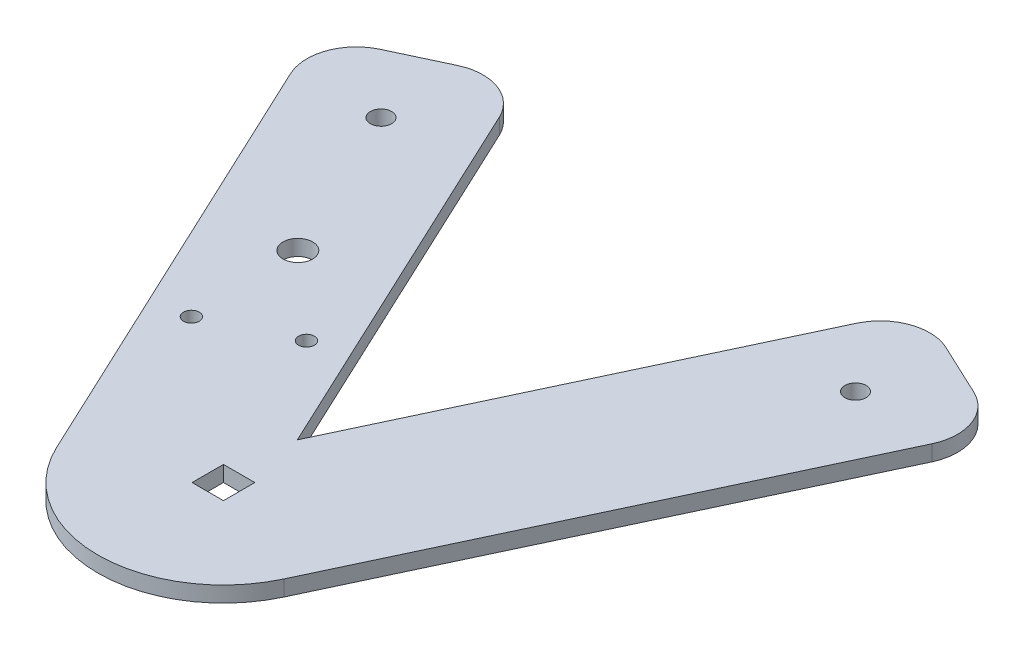
ISO-10303-21;
HEADER;
FILE_DESCRIPTION(('STEP AP214'),'2;1');
FILE_NAME('part.step','',(''),(''),'','','');
FILE_SCHEMA(('AUTOMOTIVE_DESIGN { 1 0 10303 214 1 1 1 1 }'));
ENDSEC;
DATA;
#1=APPLICATION_CONTEXT('core data for automotive mechanical design processes');
#2=APPLICATION_PROTOCOL_DEFINITION('international standard','automotive_design',2000,#1);
#3=PRODUCT_CONTEXT('',#1,'mechanical');
#4=PRODUCT('Part','Part','',(#3));
#5=PRODUCT_RELATED_PRODUCT_CATEGORY('part','',(#4));
#6=PRODUCT_DEFINITION_FORMATION('','',#4);
#7=PRODUCT_DEFINITION_CONTEXT('part definition',#1,'design');
#8=PRODUCT_DEFINITION('design','',#6,#7);
#9=PRODUCT_DEFINITION_SHAPE('','',#8);
#10=(LENGTH_UNIT() NAMED_UNIT(*) SI_UNIT(.MILLI.,.METRE.));
#11=(NAMED_UNIT(*) PLANE_ANGLE_UNIT() SI_UNIT($,.RADIAN.));
#12=(NAMED_UNIT(*) SI_UNIT($,.STERADIAN.) SOLID_ANGLE_UNIT());
#13=UNCERTAINTY_MEASURE_WITH_UNIT(LENGTH_MEASURE(1.E-05),#10,'distance_accuracy_value','');
#14=(GEOMETRIC_REPRESENTATION_CONTEXT(3) GLOBAL_UNCERTAINTY_ASSIGNED_CONTEXT((#13)) GLOBAL_UNIT_ASSIGNED_CONTEXT((#10,
#11,#12)) REPRESENTATION_CONTEXT('',''));
#15=CARTESIAN_POINT('',(0.,0.,0.));
#16=DIRECTION('',(0.,0.,1.));
#17=DIRECTION('',(1.,0.,0.));
#18=AXIS2_PLACEMENT_3D('',#15,#16,#17);
#19=CARTESIAN_POINT('',(0.,3.175,0.));
#20=DIRECTION('',(0.,-1.,0.));
#21=DIRECTION('',(0.,0.,-1.));
#22=AXIS2_PLACEMENT_3D('',#19,#20,#21);
#23=PLANE('',#22);
#24=CARTESIAN_POINT('',(-47.994,3.175,-79.8633619940959));
#25=DIRECTION('',(0.,1.,0.));
#26=DIRECTION('',(0.,0.,1.));
#27=AXIS2_PLACEMENT_3D('',#24,#25,#26);
#28=CIRCLE('',#27,2.15);
#29=CARTESIAN_POINT('',(-47.994,3.175,-77.7133619940959));
#30=VERTEX_POINT('',#29);
#31=EDGE_CURVE('E193',#30,#30,#28,.T.);
#32=ORIENTED_EDGE('',*,*,#31,.F.);
#33=EDGE_LOOP('',(#32));
#34=FACE_BOUND('',#33,.T.);
#35=CARTESIAN_POINT('',(47.994,3.175,-79.8633619940959));
#36=DIRECTION('',(0.,1.,0.));
#37=DIRECTION('',(0.,0.,1.));
#38=AXIS2_PLACEMENT_3D('',#35,#36,#37);
#39=CIRCLE('',#38,2.15);
#40=CARTESIAN_POINT('',(47.994,3.175,-77.7133619940959));
#41=VERTEX_POINT('',#40);
#42=EDGE_CURVE('E199',#41,#41,#39,.T.);
#43=ORIENTED_EDGE('',*,*,#42,.F.);
#44=EDGE_LOOP('',(#43));
#45=FACE_BOUND('',#44,.T.);
#46=DIRECTION('',(0.424774594596016,0.,-0.90529914602069));
#47=VECTOR('',#46,1.);
#48=CARTESIAN_POINT('',(22.9945983089255,3.175,10.7892747027388));
#49=LINE('',#48,#47);
#50=CARTESIAN_POINT('',(22.9945983089255,3.175,10.7892747027388));
#51=VERTEX_POINT('',#50);
#52=CARTESIAN_POINT('',(64.8611746863301,3.175,-78.4386977877557));
#53=VERTEX_POINT('',#52);
#54=EDGE_CURVE('E213',#51,#53,#49,.T.);
#55=ORIENTED_EDGE('',*,*,#54,.T.);
#56=CARTESIAN_POINT('',(55.8081832261232,3.175,-82.6864437337158));
#57=DIRECTION('',(0.,-1.,0.));
#58=DIRECTION('',(0.,0.,-1.));
#59=AXIS2_PLACEMENT_3D('',#56,#57,#58);
#60=CIRCLE('',#59,10.);
#61=CARTESIAN_POINT('',(60.0559291720833,3.175,-91.7394351939227));
#62=VERTEX_POINT('',#61);
#63=EDGE_CURVE('E266',#53,#62,#60,.F.);
#64=ORIENTED_EDGE('',*,*,#63,.T.);
#65=DIRECTION('',(-0.90529914602069,0.,-0.424774594596016));
#66=VECTOR('',#65,1.);
#67=CARTESIAN_POINT('',(40.3656727461333,3.175,-100.978282626386));
#68=LINE('',#67,#66);
#69=CARTESIAN_POINT('',(49.4186642063402,3.175,-96.7305366804259));
#70=VERTEX_POINT('',#69);
#71=EDGE_CURVE('E216',#62,#70,#68,.T.);
#72=ORIENTED_EDGE('',*,*,#71,.T.);
#73=CARTESIAN_POINT('',(45.1709182603801,3.175,-87.677545220219));
#74=DIRECTION('',(0.,-1.,0.));
#75=DIRECTION('',(0.,0.,-1.));
#76=AXIS2_PLACEMENT_3D('',#73,#74,#75);
#77=CIRCLE('',#76,10.);
#78=CARTESIAN_POINT('',(36.1179268001732,3.175,-91.9252911661792));
#79=VERTEX_POINT('',#78);
#80=EDGE_CURVE('E61',#70,#79,#77,.F.);
#81=ORIENTED_EDGE('',*,*,#80,.T.);
#82=DIRECTION('',(-0.424774594596016,0.,0.90529914602069));
#83=VECTOR('',#82,1.);
#84=CARTESIAN_POINT('',(0.,3.175,-14.9491049624547));
#85=LINE('',#84,#83);
#86=CARTESIAN_POINT('',(0.,3.175,-14.9491049624547));
#87=VERTEX_POINT('',#86);
#88=EDGE_CURVE('E218',#79,#87,#85,.T.);
#89=ORIENTED_EDGE('',*,*,#88,.T.);
#90=DIRECTION('',(-0.424774594596016,0.,-0.90529914602069));
#91=VECTOR('',#90,1.);
#92=CARTESIAN_POINT('',(-40.3656727461333,3.175,-100.978282626386));
#93=LINE('',#92,#91);
#94=CARTESIAN_POINT('',(-36.1179268001732,3.175,-91.9252911661792));
#95=VERTEX_POINT('',#94);
#96=EDGE_CURVE('E220',#87,#95,#93,.T.);
#97=ORIENTED_EDGE('',*,*,#96,.T.);
#98=CARTESIAN_POINT('',(-45.1709182603801,3.175,-87.677545220219));
#99=DIRECTION('',(0.,-1.,0.));
#100=DIRECTION('',(0.,0.,-1.));
#101=AXIS2_PLACEMENT_3D('',#98,#99,#100);
#102=CIRCLE('',#101,10.);
#103=CARTESIAN_POINT('',(-49.4186642063402,3.175,-96.7305366804259));
#104=VERTEX_POINT('',#103);
#105=EDGE_CURVE('E263',#95,#104,#102,.F.);
#106=ORIENTED_EDGE('',*,*,#105,.T.);
#107=DIRECTION('',(-0.905299146020689,0.,0.424774594596017));
#108=VECTOR('',#107,1.);
#109=CARTESIAN_POINT('',(-69.1089206322902,3.175,-87.4916892479626));
#110=LINE('',#109,#108);
#111=CARTESIAN_POINT('',(-60.0559291720833,3.175,-91.7394351939227));
#112=VERTEX_POINT('',#111);
#113=EDGE_CURVE('E205',#104,#112,#110,.T.);
#114=ORIENTED_EDGE('',*,*,#113,.T.);
#115=CARTESIAN_POINT('',(-55.8081832261231,3.175,-82.6864437337158));
#116=DIRECTION('',(0.,-1.,0.));
#117=DIRECTION('',(0.,0.,-1.));
#118=AXIS2_PLACEMENT_3D('',#115,#116,#117);
#119=CIRCLE('',#118,10.);
#120=CARTESIAN_POINT('',(-64.86117468633,3.175,-78.4386977877557));
#121=VERTEX_POINT('',#120);
#122=EDGE_CURVE('E261',#112,#121,#119,.F.);
#123=ORIENTED_EDGE('',*,*,#122,.T.);
#124=DIRECTION('',(0.424774594596016,0.,0.90529914602069));
#125=VECTOR('',#124,1.);
#126=CARTESIAN_POINT('',(-69.1089206322902,3.175,-87.4916892479626));
#127=LINE('',#126,#125);
#128=CARTESIAN_POINT('',(-22.9945983089255,3.175,10.7892747027388));
#129=VERTEX_POINT('',#128);
#130=EDGE_CURVE('E208',#121,#129,#127,.T.);
#131=ORIENTED_EDGE('',*,*,#130,.T.);
#132=CARTESIAN_POINT('',(0.,3.175,0.));
#133=DIRECTION('',(0.,1.,0.));
#134=DIRECTION('',(0.,0.,-1.));
#135=AXIS2_PLACEMENT_3D('',#132,#133,#134);
#136=CIRCLE('',#135,25.4);
#137=EDGE_CURVE('E211',#129,#51,#136,.T.);
#138=ORIENTED_EDGE('',*,*,#137,.T.);
#139=EDGE_LOOP('',(#55,#64,#72,#81,#89,#97,#106,#114,#123,#131,#138));
#140=FACE_BOUND('',#139,.T.);
#141=DIRECTION('',(0.,0.,-1.));
#142=VECTOR('',#141,1.);
#143=CARTESIAN_POINT('',(3.175,3.175,3.175));
#144=LINE('',#143,#142);
#145=CARTESIAN_POINT('',(3.175,3.175,3.175));
#146=VERTEX_POINT('',#145);
#147=CARTESIAN_POINT('',(3.175,3.175,-3.175));
#148=VERTEX_POINT('',#147);
#149=EDGE_CURVE('E149',#146,#148,#144,.T.);
#150=ORIENTED_EDGE('',*,*,#149,.F.);
#151=DIRECTION('',(1.,0.,0.));
#152=VECTOR('',#151,1.);
#153=CARTESIAN_POINT('',(-3.175,3.175,3.175));
#154=LINE('',#153,#152);
#155=CARTESIAN_POINT('',(-3.175,3.175,3.175));
#156=VERTEX_POINT('',#155);
#157=EDGE_CURVE('E175',#156,#146,#154,.T.);
#158=ORIENTED_EDGE('',*,*,#157,.F.);
#159=DIRECTION('',(0.,0.,1.));
#160=VECTOR('',#159,1.);
#161=CARTESIAN_POINT('',(-3.175,3.175,3.175));
#162=LINE('',#161,#160);
#163=CARTESIAN_POINT('',(-3.175,3.175,-3.175));
#164=VERTEX_POINT('',#163);
#165=EDGE_CURVE('E173',#164,#156,#162,.T.);
#166=ORIENTED_EDGE('',*,*,#165,.F.);
#167=DIRECTION('',(-1.,0.,0.));
#168=VECTOR('',#167,1.);
#169=CARTESIAN_POINT('',(-3.175,3.175,-3.175));
#170=LINE('',#169,#168);
#171=EDGE_CURVE('E159',#148,#164,#170,.T.);
#172=ORIENTED_EDGE('',*,*,#171,.F.);
#173=EDGE_LOOP('',(#150,#158,#166,#172));
#174=FACE_BOUND('',#173,.T.);
#175=CARTESIAN_POINT('',(-33.1268891891394,3.175,-48.1778918833717));
#176=DIRECTION('',(0.,1.,0.));
#177=DIRECTION('',(0.,0.,1.));
#178=AXIS2_PLACEMENT_3D('',#175,#176,#177);
#179=CIRCLE('',#178,3.);
#180=CARTESIAN_POINT('',(-33.1268891891394,3.175,-45.1778918833717));
#181=VERTEX_POINT('',#180);
#182=EDGE_CURVE('E182',#181,#181,#179,.T.);
#183=ORIENTED_EDGE('',*,*,#182,.F.);
#184=EDGE_LOOP('',(#183));
#185=FACE_BOUND('',#184,.T.);
#186=CARTESIAN_POINT('',(-16.4551650127805,3.175,-33.2455071780607));
#187=DIRECTION('',(0.,1.,0.));
#188=DIRECTION('',(0.,0.,1.));
#189=AXIS2_PLACEMENT_3D('',#186,#187,#188);
#190=CIRCLE('',#189,1.6);
#191=CARTESIAN_POINT('',(-16.4551650127805,3.175,-31.6455071780607));
#192=VERTEX_POINT('',#191);
#193=EDGE_CURVE('E416',#192,#192,#190,.T.);
#194=ORIENTED_EDGE('',*,*,#193,.F.);
#195=EDGE_LOOP('',(#194));
#196=FACE_BOUND('',#195,.T.);
#197=CARTESIAN_POINT('',(-32.2979000681425,3.175,-25.8119517726304));
#198=DIRECTION('',(0.,1.,0.));
#199=DIRECTION('',(0.,0.,1.));
#200=AXIS2_PLACEMENT_3D('',#197,#198,#199);
#201=CIRCLE('',#200,1.60000000000001);
#202=CARTESIAN_POINT('',(-32.2979000681425,3.175,-24.2119517726304));
#203=VERTEX_POINT('',#202);
#204=EDGE_CURVE('E411',#203,#203,#201,.T.);
#205=ORIENTED_EDGE('',*,*,#204,.F.);
#206=EDGE_LOOP('',(#205));
#207=FACE_BOUND('',#206,.T.);
#208=ADVANCED_FACE('F39',(#34,#45,#140,#174,#185,#196,#207),#23,.F.);
#209=CARTESIAN_POINT('',(0.,0.,0.));
#210=DIRECTION('',(0.,-1.,0.));
#211=DIRECTION('',(0.,0.,-1.));
#212=AXIS2_PLACEMENT_3D('',#209,#210,#211);
#213=PLANE('',#212);
#214=CARTESIAN_POINT('',(-16.4551650127805,0.,-33.2455071780607));
#215=DIRECTION('',(0.,1.,0.));
#216=DIRECTION('',(0.,0.,1.));
#217=AXIS2_PLACEMENT_3D('',#214,#215,#216);
#218=CIRCLE('',#217,1.6);
#219=CARTESIAN_POINT('',(-16.4551650127805,0.,-31.6455071780607));
#220=VERTEX_POINT('',#219);
#221=EDGE_CURVE('E413',#220,#220,#218,.T.);
#222=ORIENTED_EDGE('',*,*,#221,.T.);
#223=EDGE_LOOP('',(#222));
#224=FACE_BOUND('',#223,.T.);
#225=DIRECTION('',(1.,0.,0.));
#226=VECTOR('',#225,1.);
#227=CARTESIAN_POINT('',(-3.175,0.,3.175));
#228=LINE('',#227,#226);
#229=CARTESIAN_POINT('',(-3.175,0.,3.175));
#230=VERTEX_POINT('',#229);
#231=CARTESIAN_POINT('',(3.175,0.,3.175));
#232=VERTEX_POINT('',#231);
#233=EDGE_CURVE('E160',#230,#232,#228,.T.);
#234=ORIENTED_EDGE('',*,*,#233,.T.);
#235=DIRECTION('',(0.,0.,-1.));
#236=VECTOR('',#235,1.);
#237=CARTESIAN_POINT('',(3.175,0.,3.175));
#238=LINE('',#237,#236);
#239=CARTESIAN_POINT('',(3.175,0.,-3.175));
#240=VERTEX_POINT('',#239);
#241=EDGE_CURVE('E180',#232,#240,#238,.T.);
#242=ORIENTED_EDGE('',*,*,#241,.T.);
#243=DIRECTION('',(-1.,0.,0.));
#244=VECTOR('',#243,1.);
#245=CARTESIAN_POINT('',(-3.175,0.,-3.175));
#246=LINE('',#245,#244);
#247=CARTESIAN_POINT('',(-3.175,0.,-3.175));
#248=VERTEX_POINT('',#247);
#249=EDGE_CURVE('E166',#240,#248,#246,.T.);
#250=ORIENTED_EDGE('',*,*,#249,.T.);
#251=DIRECTION('',(0.,0.,1.));
#252=VECTOR('',#251,1.);
#253=CARTESIAN_POINT('',(-3.175,0.,3.175));
#254=LINE('',#253,#252);
#255=EDGE_CURVE('E184',#248,#230,#254,.T.);
#256=ORIENTED_EDGE('',*,*,#255,.T.);
#257=EDGE_LOOP('',(#234,#242,#250,#256));
#258=FACE_BOUND('',#257,.T.);
#259=CARTESIAN_POINT('',(-47.994,0.,-79.8633619940959));
#260=DIRECTION('',(0.,1.,0.));
#261=DIRECTION('',(0.,0.,1.));
#262=AXIS2_PLACEMENT_3D('',#259,#260,#261);
#263=CIRCLE('',#262,2.15);
#264=CARTESIAN_POINT('',(-47.994,0.,-77.7133619940959));
#265=VERTEX_POINT('',#264);
#266=EDGE_CURVE('E167',#265,#265,#263,.T.);
#267=ORIENTED_EDGE('',*,*,#266,.T.);
#268=EDGE_LOOP('',(#267));
#269=FACE_BOUND('',#268,.T.);
#270=DIRECTION('',(-0.90529914602069,0.,-0.424774594596016));
#271=VECTOR('',#270,1.);
#272=CARTESIAN_POINT('',(40.3656727461333,0.,-100.978282626386));
#273=LINE('',#272,#271);
#274=CARTESIAN_POINT('',(60.0559291720833,0.,-91.7394351939227));
#275=VERTEX_POINT('',#274);
#276=CARTESIAN_POINT('',(49.4186642063402,0.,-96.7305366804259));
#277=VERTEX_POINT('',#276);
#278=EDGE_CURVE('E232',#275,#277,#273,.T.);
#279=ORIENTED_EDGE('',*,*,#278,.F.);
#280=CARTESIAN_POINT('',(55.8081832261232,0.,-82.6864437337158));
#281=DIRECTION('',(0.,-1.,0.));
#282=DIRECTION('',(0.,0.,-1.));
#283=AXIS2_PLACEMENT_3D('',#280,#281,#282);
#284=CIRCLE('',#283,10.);
#285=CARTESIAN_POINT('',(64.8611746863301,0.,-78.4386977877557));
#286=VERTEX_POINT('',#285);
#287=EDGE_CURVE('E257',#275,#286,#284,.T.);
#288=ORIENTED_EDGE('',*,*,#287,.T.);
#289=DIRECTION('',(0.424774594596016,0.,-0.90529914602069));
#290=VECTOR('',#289,1.);
#291=CARTESIAN_POINT('',(22.9945983089255,0.,10.7892747027388));
#292=LINE('',#291,#290);
#293=CARTESIAN_POINT('',(22.9945983089255,0.,10.7892747027388));
#294=VERTEX_POINT('',#293);
#295=EDGE_CURVE('E229',#294,#286,#292,.T.);
#296=ORIENTED_EDGE('',*,*,#295,.F.);
#297=CARTESIAN_POINT('',(0.,0.,0.));
#298=DIRECTION('',(0.,1.,0.));
#299=DIRECTION('',(0.,0.,-1.));
#300=AXIS2_PLACEMENT_3D('',#297,#298,#299);
#301=CIRCLE('',#300,25.4);
#302=CARTESIAN_POINT('',(-22.9945983089255,0.,10.7892747027388));
#303=VERTEX_POINT('',#302);
#304=EDGE_CURVE('E227',#303,#294,#301,.T.);
#305=ORIENTED_EDGE('',*,*,#304,.F.);
#306=DIRECTION('',(0.424774594596016,0.,0.90529914602069));
#307=VECTOR('',#306,1.);
#308=CARTESIAN_POINT('',(-69.1089206322902,0.,-87.4916892479626));
#309=LINE('',#308,#307);
#310=CARTESIAN_POINT('',(-64.86117468633,0.,-78.4386977877557));
#311=VERTEX_POINT('',#310);
#312=EDGE_CURVE('E225',#311,#303,#309,.T.);
#313=ORIENTED_EDGE('',*,*,#312,.F.);
#314=CARTESIAN_POINT('',(-55.8081832261231,0.,-82.6864437337158));
#315=DIRECTION('',(0.,-1.,0.));
#316=DIRECTION('',(0.,0.,-1.));
#317=AXIS2_PLACEMENT_3D('',#314,#315,#316);
#318=CIRCLE('',#317,10.);
#319=CARTESIAN_POINT('',(-60.0559291720833,0.,-91.7394351939227));
#320=VERTEX_POINT('',#319);
#321=EDGE_CURVE('E251',#311,#320,#318,.T.);
#322=ORIENTED_EDGE('',*,*,#321,.T.);
#323=DIRECTION('',(-0.905299146020689,0.,0.424774594596017));
#324=VECTOR('',#323,1.);
#325=CARTESIAN_POINT('',(-69.1089206322902,0.,-87.4916892479626));
#326=LINE('',#325,#324);
#327=CARTESIAN_POINT('',(-49.4186642063402,0.,-96.7305366804259));
#328=VERTEX_POINT('',#327);
#329=EDGE_CURVE('E202',#328,#320,#326,.T.);
#330=ORIENTED_EDGE('',*,*,#329,.F.);
#331=CARTESIAN_POINT('',(-45.1709182603801,0.,-87.677545220219));
#332=DIRECTION('',(0.,-1.,0.));
#333=DIRECTION('',(0.,0.,-1.));
#334=AXIS2_PLACEMENT_3D('',#331,#332,#333);
#335=CIRCLE('',#334,10.);
#336=CARTESIAN_POINT('',(-36.1179268001732,0.,-91.9252911661792));
#337=VERTEX_POINT('',#336);
#338=EDGE_CURVE('E253',#328,#337,#335,.T.);
#339=ORIENTED_EDGE('',*,*,#338,.T.);
#340=DIRECTION('',(-0.424774594596016,0.,-0.90529914602069));
#341=VECTOR('',#340,1.);
#342=CARTESIAN_POINT('',(-40.3656727461333,0.,-100.978282626386));
#343=LINE('',#342,#341);
#344=CARTESIAN_POINT('',(0.,0.,-14.9491049624547));
#345=VERTEX_POINT('',#344);
#346=EDGE_CURVE('E209',#345,#337,#343,.T.);
#347=ORIENTED_EDGE('',*,*,#346,.F.);
#348=DIRECTION('',(-0.424774594596016,0.,0.90529914602069));
#349=VECTOR('',#348,1.);
#350=CARTESIAN_POINT('',(0.,0.,-14.9491049624547));
#351=LINE('',#350,#349);
#352=CARTESIAN_POINT('',(36.1179268001732,0.,-91.9252911661792));
#353=VERTEX_POINT('',#352);
#354=EDGE_CURVE('E235',#353,#345,#351,.T.);
#355=ORIENTED_EDGE('',*,*,#354,.F.);
#356=CARTESIAN_POINT('',(45.1709182603801,0.,-87.677545220219));
#357=DIRECTION('',(0.,-1.,0.));
#358=DIRECTION('',(0.,0.,-1.));
#359=AXIS2_PLACEMENT_3D('',#356,#357,#358);
#360=CIRCLE('',#359,10.);
#361=EDGE_CURVE('E255',#353,#277,#360,.T.);
#362=ORIENTED_EDGE('',*,*,#361,.T.);
#363=EDGE_LOOP('',(#279,#288,#296,#305,#313,#322,#330,#339,#347,#355,#362));
#364=FACE_BOUND('',#363,.T.);
#365=CARTESIAN_POINT('',(47.994,0.,-79.8633619940959));
#366=DIRECTION('',(0.,1.,0.));
#367=DIRECTION('',(0.,0.,1.));
#368=AXIS2_PLACEMENT_3D('',#365,#366,#367);
#369=CIRCLE('',#368,2.15);
#370=CARTESIAN_POINT('',(47.994,0.,-77.7133619940959));
#371=VERTEX_POINT('',#370);
#372=EDGE_CURVE('E196',#371,#371,#369,.T.);
#373=ORIENTED_EDGE('',*,*,#372,.T.);
#374=EDGE_LOOP('',(#373));
#375=FACE_BOUND('',#374,.T.);
#376=CARTESIAN_POINT('',(-33.1268891891394,0.,-48.1778918833717));
#377=DIRECTION('',(0.,1.,0.));
#378=DIRECTION('',(0.,0.,1.));
#379=AXIS2_PLACEMENT_3D('',#376,#377,#378);
#380=CIRCLE('',#379,3.);
#381=CARTESIAN_POINT('',(-33.1268891891394,0.,-45.1778918833717));
#382=VERTEX_POINT('',#381);
#383=EDGE_CURVE('E407',#382,#382,#380,.T.);
#384=ORIENTED_EDGE('',*,*,#383,.T.);
#385=EDGE_LOOP('',(#384));
#386=FACE_BOUND('',#385,.T.);
#387=CARTESIAN_POINT('',(-32.2979000681425,0.,-25.8119517726304));
#388=DIRECTION('',(0.,1.,0.));
#389=DIRECTION('',(0.,0.,1.));
#390=AXIS2_PLACEMENT_3D('',#387,#388,#389);
#391=CIRCLE('',#390,1.60000000000001);
#392=CARTESIAN_POINT('',(-32.2979000681425,0.,-24.2119517726304));
#393=VERTEX_POINT('',#392);
#394=EDGE_CURVE('E410',#393,#393,#391,.T.);
#395=ORIENTED_EDGE('',*,*,#394,.T.);
#396=EDGE_LOOP('',(#395));
#397=FACE_BOUND('',#396,.T.);
#398=ADVANCED_FACE('F285',(#224,#258,#269,#364,#375,#386,#397),#213,.T.);
#399=CARTESIAN_POINT('',(-69.1089206322902,3.175,-87.4916892479626));
#400=DIRECTION('',(0.424774594596017,0.,0.905299146020689));
#401=DIRECTION('',(0.90529914602069,0.,-0.424774594596017));
#402=AXIS2_PLACEMENT_3D('',#399,#400,#401);
#403=PLANE('',#402);
#404=ORIENTED_EDGE('',*,*,#113,.F.);
#405=DIRECTION('',(0.,-1.,0.));
#406=VECTOR('',#405,1.);
#407=CARTESIAN_POINT('',(-49.4186642063402,3.175,-96.7305366804259));
#408=LINE('',#407,#406);
#409=EDGE_CURVE('E273',#104,#328,#408,.T.);
#410=ORIENTED_EDGE('',*,*,#409,.T.);
#411=ORIENTED_EDGE('',*,*,#329,.T.);
#412=DIRECTION('',(0.,-1.,0.));
#413=VECTOR('',#412,1.);
#414=CARTESIAN_POINT('',(-60.0559291720833,3.175,-91.7394351939227));
#415=LINE('',#414,#413);
#416=EDGE_CURVE('E271',#320,#112,#415,.F.);
#417=ORIENTED_EDGE('',*,*,#416,.T.);
#418=EDGE_LOOP('',(#404,#410,#411,#417));
#419=FACE_BOUND('',#418,.T.);
#420=ADVANCED_FACE('F279',(#419),#403,.F.);
#421=CARTESIAN_POINT('',(-69.1089206322902,3.175,-87.4916892479626));
#422=DIRECTION('',(0.90529914602069,0.,-0.424774594596016));
#423=DIRECTION('',(-0.424774594596016,0.,-0.90529914602069));
#424=AXIS2_PLACEMENT_3D('',#421,#422,#423);
#425=PLANE('',#424);
#426=ORIENTED_EDGE('',*,*,#130,.F.);
#427=DIRECTION('',(0.,-1.,0.));
#428=VECTOR('',#427,1.);
#429=CARTESIAN_POINT('',(-64.86117468633,3.175,-78.4386977877557));
#430=LINE('',#429,#428);
#431=EDGE_CURVE('E11',#121,#311,#430,.T.);
#432=ORIENTED_EDGE('',*,*,#431,.T.);
#433=ORIENTED_EDGE('',*,*,#312,.T.);
#434=DIRECTION('',(0.,-1.,0.));
#435=VECTOR('',#434,1.);
#436=CARTESIAN_POINT('',(-22.9945983089255,3.175,10.7892747027388));
#437=LINE('',#436,#435);
#438=EDGE_CURVE('E243',#129,#303,#437,.T.);
#439=ORIENTED_EDGE('',*,*,#438,.F.);
#440=EDGE_LOOP('',(#426,#432,#433,#439));
#441=FACE_BOUND('',#440,.T.);
#442=ADVANCED_FACE('F295',(#441),#425,.F.);
#443=CARTESIAN_POINT('',(0.,3.175,0.));
#444=DIRECTION('',(0.,-1.,0.));
#445=DIRECTION('',(0.,0.,-1.));
#446=AXIS2_PLACEMENT_3D('',#443,#444,#445);
#447=CYLINDRICAL_SURFACE('',#446,25.4);
#448=ORIENTED_EDGE('',*,*,#304,.T.);
#449=DIRECTION('',(0.,-1.,0.));
#450=VECTOR('',#449,1.);
#451=CARTESIAN_POINT('',(22.9945983089255,3.175,10.7892747027388));
#452=LINE('',#451,#450);
#453=EDGE_CURVE('E240',#51,#294,#452,.T.);
#454=ORIENTED_EDGE('',*,*,#453,.F.);
#455=ORIENTED_EDGE('',*,*,#137,.F.);
#456=ORIENTED_EDGE('',*,*,#438,.T.);
#457=EDGE_LOOP('',(#448,#454,#455,#456));
#458=FACE_BOUND('',#457,.T.);
#459=ADVANCED_FACE('F338',(#458),#447,.T.);
#460=CARTESIAN_POINT('',(22.9945983089255,3.175,10.7892747027388));
#461=DIRECTION('',(-0.90529914602069,0.,-0.424774594596016));
#462=DIRECTION('',(-0.424774594596016,0.,0.90529914602069));
#463=AXIS2_PLACEMENT_3D('',#460,#461,#462);
#464=PLANE('',#463);
#465=ORIENTED_EDGE('',*,*,#295,.T.);
#466=DIRECTION('',(0.,-1.,0.));
#467=VECTOR('',#466,1.);
#468=CARTESIAN_POINT('',(64.86117468633,3.175,-78.4386977877557));
#469=LINE('',#468,#467);
#470=EDGE_CURVE('E259',#286,#53,#469,.F.);
#471=ORIENTED_EDGE('',*,*,#470,.T.);
#472=ORIENTED_EDGE('',*,*,#54,.F.);
#473=ORIENTED_EDGE('',*,*,#453,.T.);
#474=EDGE_LOOP('',(#465,#471,#472,#473));
#475=FACE_BOUND('',#474,.T.);
#476=ADVANCED_FACE('F334',(#475),#464,.F.);
#477=CARTESIAN_POINT('',(40.3656727461333,3.175,-100.978282626386));
#478=DIRECTION('',(-0.424774594596016,0.,0.90529914602069));
#479=DIRECTION('',(0.90529914602069,0.,0.424774594596016));
#480=AXIS2_PLACEMENT_3D('',#477,#478,#479);
#481=PLANE('',#480);
#482=ORIENTED_EDGE('',*,*,#71,.F.);
#483=DIRECTION('',(0.,-1.,0.));
#484=VECTOR('',#483,1.);
#485=CARTESIAN_POINT('',(60.0559291720833,3.175,-91.7394351939227));
#486=LINE('',#485,#484);
#487=EDGE_CURVE('E248',#62,#275,#486,.T.);
#488=ORIENTED_EDGE('',*,*,#487,.T.);
#489=ORIENTED_EDGE('',*,*,#278,.T.);
#490=DIRECTION('',(0.,-1.,0.));
#491=VECTOR('',#490,1.);
#492=CARTESIAN_POINT('',(49.4186642063402,3.175,-96.7305366804259));
#493=LINE('',#492,#491);
#494=EDGE_CURVE('E246',#277,#70,#493,.F.);
#495=ORIENTED_EDGE('',*,*,#494,.T.);
#496=EDGE_LOOP('',(#482,#488,#489,#495));
#497=FACE_BOUND('',#496,.T.);
#498=ADVANCED_FACE('F330',(#497),#481,.F.);
#499=CARTESIAN_POINT('',(0.,3.175,-14.9491049624547));
#500=DIRECTION('',(0.90529914602069,0.,0.424774594596016));
#501=DIRECTION('',(0.424774594596016,0.,-0.90529914602069));
#502=AXIS2_PLACEMENT_3D('',#499,#500,#501);
#503=PLANE('',#502);
#504=ORIENTED_EDGE('',*,*,#88,.F.);
#505=DIRECTION('',(0.,-1.,0.));
#506=VECTOR('',#505,1.);
#507=CARTESIAN_POINT('',(36.1179268001732,3.175,-91.9252911661792));
#508=LINE('',#507,#506);
#509=EDGE_CURVE('E268',#79,#353,#508,.T.);
#510=ORIENTED_EDGE('',*,*,#509,.T.);
#511=ORIENTED_EDGE('',*,*,#354,.T.);
#512=DIRECTION('',(0.,-1.,0.));
#513=VECTOR('',#512,1.);
#514=CARTESIAN_POINT('',(0.,3.175,-14.9491049624547));
#515=LINE('',#514,#513);
#516=EDGE_CURVE('E222',#87,#345,#515,.T.);
#517=ORIENTED_EDGE('',*,*,#516,.F.);
#518=EDGE_LOOP('',(#504,#510,#511,#517));
#519=FACE_BOUND('',#518,.T.);
#520=ADVANCED_FACE('F327',(#519),#503,.F.);
#521=CARTESIAN_POINT('',(-40.3656727461333,3.175,-100.978282626386));
#522=DIRECTION('',(-0.90529914602069,0.,0.424774594596016));
#523=DIRECTION('',(0.424774594596016,0.,0.90529914602069));
#524=AXIS2_PLACEMENT_3D('',#521,#522,#523);
#525=PLANE('',#524);
#526=ORIENTED_EDGE('',*,*,#346,.T.);
#527=DIRECTION('',(0.,-1.,0.));
#528=VECTOR('',#527,1.);
#529=CARTESIAN_POINT('',(-36.1179268001732,3.175,-91.9252911661792));
#530=LINE('',#529,#528);
#531=EDGE_CURVE('E47',#337,#95,#530,.F.);
#532=ORIENTED_EDGE('',*,*,#531,.T.);
#533=ORIENTED_EDGE('',*,*,#96,.F.);
#534=ORIENTED_EDGE('',*,*,#516,.T.);
#535=EDGE_LOOP('',(#526,#532,#533,#534));
#536=FACE_BOUND('',#535,.T.);
#537=ADVANCED_FACE('F324',(#536),#525,.F.);
#538=CARTESIAN_POINT('',(47.994,3.175,-79.8633619940959));
#539=DIRECTION('',(0.,-1.,0.));
#540=DIRECTION('',(0.,0.,-1.));
#541=AXIS2_PLACEMENT_3D('',#538,#539,#540);
#542=CYLINDRICAL_SURFACE('',#541,2.15);
#543=ORIENTED_EDGE('',*,*,#42,.T.);
#544=EDGE_LOOP('',(#543));
#545=FACE_BOUND('',#544,.T.);
#546=ORIENTED_EDGE('',*,*,#372,.F.);
#547=EDGE_LOOP('',(#546));
#548=FACE_BOUND('',#547,.T.);
#549=ADVANCED_FACE('F321',(#545,#548),#542,.F.);
#550=CARTESIAN_POINT('',(-47.994,3.175,-79.8633619940959));
#551=DIRECTION('',(0.,-1.,0.));
#552=DIRECTION('',(0.,0.,-1.));
#553=AXIS2_PLACEMENT_3D('',#550,#551,#552);
#554=CYLINDRICAL_SURFACE('',#553,2.15);
#555=ORIENTED_EDGE('',*,*,#31,.T.);
#556=EDGE_LOOP('',(#555));
#557=FACE_BOUND('',#556,.T.);
#558=ORIENTED_EDGE('',*,*,#266,.F.);
#559=EDGE_LOOP('',(#558));
#560=FACE_BOUND('',#559,.T.);
#561=ADVANCED_FACE('F388',(#557,#560),#554,.F.);
#562=CARTESIAN_POINT('',(3.175,3.175,3.175));
#563=DIRECTION('',(-1.,0.,0.));
#564=DIRECTION('',(0.,0.,1.));
#565=AXIS2_PLACEMENT_3D('',#562,#563,#564);
#566=PLANE('',#565);
#567=ORIENTED_EDGE('',*,*,#241,.F.);
#568=DIRECTION('',(0.,-1.,0.));
#569=VECTOR('',#568,1.);
#570=CARTESIAN_POINT('',(3.175,3.175,3.175));
#571=LINE('',#570,#569);
#572=EDGE_CURVE('E155',#146,#232,#571,.T.);
#573=ORIENTED_EDGE('',*,*,#572,.F.);
#574=ORIENTED_EDGE('',*,*,#149,.T.);
#575=DIRECTION('',(0.,-1.,0.));
#576=VECTOR('',#575,1.);
#577=CARTESIAN_POINT('',(3.175,3.175,-3.175));
#578=LINE('',#577,#576);
#579=EDGE_CURVE('E152',#148,#240,#578,.T.);
#580=ORIENTED_EDGE('',*,*,#579,.T.);
#581=EDGE_LOOP('',(#567,#573,#574,#580));
#582=FACE_BOUND('',#581,.T.);
#583=ADVANCED_FACE('F151',(#582),#566,.T.);
#584=CARTESIAN_POINT('',(-3.175,3.175,-3.175));
#585=DIRECTION('',(0.,0.,1.));
#586=DIRECTION('',(1.,0.,0.));
#587=AXIS2_PLACEMENT_3D('',#584,#585,#586);
#588=PLANE('',#587);
#589=ORIENTED_EDGE('',*,*,#249,.F.);
#590=ORIENTED_EDGE('',*,*,#579,.F.);
#591=ORIENTED_EDGE('',*,*,#171,.T.);
#592=DIRECTION('',(0.,-1.,0.));
#593=VECTOR('',#592,1.);
#594=CARTESIAN_POINT('',(-3.175,3.175,-3.175));
#595=LINE('',#594,#593);
#596=EDGE_CURVE('E168',#164,#248,#595,.T.);
#597=ORIENTED_EDGE('',*,*,#596,.T.);
#598=EDGE_LOOP('',(#589,#590,#591,#597));
#599=FACE_BOUND('',#598,.T.);
#600=ADVANCED_FACE('F163',(#599),#588,.T.);
#601=CARTESIAN_POINT('',(-3.175,3.175,3.175));
#602=DIRECTION('',(1.,0.,0.));
#603=DIRECTION('',(0.,0.,-1.));
#604=AXIS2_PLACEMENT_3D('',#601,#602,#603);
#605=PLANE('',#604);
#606=ORIENTED_EDGE('',*,*,#255,.F.);
#607=ORIENTED_EDGE('',*,*,#596,.F.);
#608=ORIENTED_EDGE('',*,*,#165,.T.);
#609=DIRECTION('',(0.,-1.,0.));
#610=VECTOR('',#609,1.);
#611=CARTESIAN_POINT('',(-3.175,3.175,3.175));
#612=LINE('',#611,#610);
#613=EDGE_CURVE('E190',#156,#230,#612,.T.);
#614=ORIENTED_EDGE('',*,*,#613,.T.);
#615=EDGE_LOOP('',(#606,#607,#608,#614));
#616=FACE_BOUND('',#615,.T.);
#617=ADVANCED_FACE('F380',(#616),#605,.T.);
#618=CARTESIAN_POINT('',(-3.175,3.175,3.175));
#619=DIRECTION('',(0.,0.,-1.));
#620=DIRECTION('',(-1.,0.,0.));
#621=AXIS2_PLACEMENT_3D('',#618,#619,#620);
#622=PLANE('',#621);
#623=ORIENTED_EDGE('',*,*,#233,.F.);
#624=ORIENTED_EDGE('',*,*,#613,.F.);
#625=ORIENTED_EDGE('',*,*,#157,.T.);
#626=ORIENTED_EDGE('',*,*,#572,.T.);
#627=EDGE_LOOP('',(#623,#624,#625,#626));
#628=FACE_BOUND('',#627,.T.);
#629=ADVANCED_FACE('F376',(#628),#622,.T.);
#630=CARTESIAN_POINT('',(-33.1268891891394,3.175,-48.1778918833717));
#631=DIRECTION('',(0.,-1.,0.));
#632=DIRECTION('',(0.,0.,-1.));
#633=AXIS2_PLACEMENT_3D('',#630,#631,#632);
#634=CYLINDRICAL_SURFACE('',#633,3.);
#635=ORIENTED_EDGE('',*,*,#182,.T.);
#636=EDGE_LOOP('',(#635));
#637=FACE_BOUND('',#636,.T.);
#638=ORIENTED_EDGE('',*,*,#383,.F.);
#639=EDGE_LOOP('',(#638));
#640=FACE_BOUND('',#639,.T.);
#641=ADVANCED_FACE('F368',(#637,#640),#634,.F.);
#642=CARTESIAN_POINT('',(-16.4551650127805,3.175,-33.2455071780607));
#643=DIRECTION('',(0.,-1.,0.));
#644=DIRECTION('',(0.,0.,-1.));
#645=AXIS2_PLACEMENT_3D('',#642,#643,#644);
#646=CYLINDRICAL_SURFACE('',#645,1.6);
#647=ORIENTED_EDGE('',*,*,#193,.T.);
#648=EDGE_LOOP('',(#647));
#649=FACE_BOUND('',#648,.T.);
#650=ORIENTED_EDGE('',*,*,#221,.F.);
#651=EDGE_LOOP('',(#650));
#652=FACE_BOUND('',#651,.T.);
#653=ADVANCED_FACE('F352',(#649,#652),#646,.F.);
#654=CARTESIAN_POINT('',(-32.2979000681425,3.175,-25.8119517726304));
#655=DIRECTION('',(0.,-1.,0.));
#656=DIRECTION('',(0.,0.,-1.));
#657=AXIS2_PLACEMENT_3D('',#654,#655,#656);
#658=CYLINDRICAL_SURFACE('',#657,1.60000000000001);
#659=ORIENTED_EDGE('',*,*,#204,.T.);
#660=EDGE_LOOP('',(#659));
#661=FACE_BOUND('',#660,.T.);
#662=ORIENTED_EDGE('',*,*,#394,.F.);
#663=EDGE_LOOP('',(#662));
#664=FACE_BOUND('',#663,.T.);
#665=ADVANCED_FACE('F348',(#661,#664),#658,.F.);
#666=CARTESIAN_POINT('',(55.8081832261232,3.175,-82.6864437337158));
#667=DIRECTION('',(0.,-1.,0.));
#668=DIRECTION('',(0.,0.,-1.));
#669=AXIS2_PLACEMENT_3D('',#666,#667,#668);
#670=CYLINDRICAL_SURFACE('',#669,10.);
#671=ORIENTED_EDGE('',*,*,#63,.F.);
#672=ORIENTED_EDGE('',*,*,#470,.F.);
#673=ORIENTED_EDGE('',*,*,#287,.F.);
#674=ORIENTED_EDGE('',*,*,#487,.F.);
#675=EDGE_LOOP('',(#671,#672,#673,#674));
#676=FACE_BOUND('',#675,.T.);
#677=ADVANCED_FACE('F306',(#676),#670,.T.);
#678=CARTESIAN_POINT('',(45.1709182603801,3.175,-87.677545220219));
#679=DIRECTION('',(0.,-1.,0.));
#680=DIRECTION('',(0.,0.,-1.));
#681=AXIS2_PLACEMENT_3D('',#678,#679,#680);
#682=CYLINDRICAL_SURFACE('',#681,10.);
#683=ORIENTED_EDGE('',*,*,#80,.F.);
#684=ORIENTED_EDGE('',*,*,#494,.F.);
#685=ORIENTED_EDGE('',*,*,#361,.F.);
#686=ORIENTED_EDGE('',*,*,#509,.F.);
#687=EDGE_LOOP('',(#683,#684,#685,#686));
#688=FACE_BOUND('',#687,.T.);
#689=ADVANCED_FACE('F301',(#688),#682,.T.);
#690=CARTESIAN_POINT('',(-45.1709182603801,3.175,-87.677545220219));
#691=DIRECTION('',(0.,-1.,0.));
#692=DIRECTION('',(0.,0.,-1.));
#693=AXIS2_PLACEMENT_3D('',#690,#691,#692);
#694=CYLINDRICAL_SURFACE('',#693,10.);
#695=ORIENTED_EDGE('',*,*,#105,.F.);
#696=ORIENTED_EDGE('',*,*,#531,.F.);
#697=ORIENTED_EDGE('',*,*,#338,.F.);
#698=ORIENTED_EDGE('',*,*,#409,.F.);
#699=EDGE_LOOP('',(#695,#696,#697,#698));
#700=FACE_BOUND('',#699,.T.);
#701=ADVANCED_FACE('F299',(#700),#694,.T.);
#702=CARTESIAN_POINT('',(-55.8081832261231,3.175,-82.6864437337158));
#703=DIRECTION('',(0.,-1.,0.));
#704=DIRECTION('',(0.,0.,-1.));
#705=AXIS2_PLACEMENT_3D('',#702,#703,#704);
#706=CYLINDRICAL_SURFACE('',#705,10.);
#707=ORIENTED_EDGE('',*,*,#122,.F.);
#708=ORIENTED_EDGE('',*,*,#416,.F.);
#709=ORIENTED_EDGE('',*,*,#321,.F.);
#710=ORIENTED_EDGE('',*,*,#431,.F.);
#711=EDGE_LOOP('',(#707,#708,#709,#710));
#712=FACE_BOUND('',#711,.T.);
#713=ADVANCED_FACE('F41',(#712),#706,.T.);
#714=CLOSED_SHELL('',(#208,#398,#420,#442,#459,#476,#498,#520,#537,#549,#561,#583,#600,#617,
#629,#641,#653,#665,#677,#689,#701,#713));
#715=MANIFOLD_SOLID_BREP('B2',#714);
#716=ADVANCED_BREP_SHAPE_REPRESENTATION('',(#18,#715),#14);
#717=SHAPE_DEFINITION_REPRESENTATION(#9,#716);
ENDSEC;
END-ISO-10303-21;
